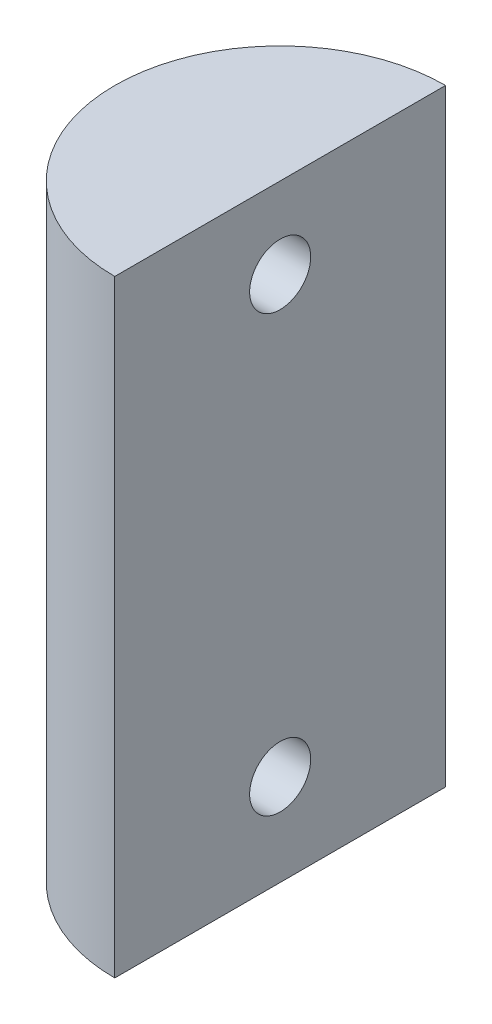
ISO-10303-21;
HEADER;
FILE_DESCRIPTION(('STEP AP214'),'2;1');
FILE_NAME('part.step','',(''),(''),'','','');
FILE_SCHEMA(('AUTOMOTIVE_DESIGN { 1 0 10303 214 1 1 1 1 }'));
ENDSEC;
DATA;
#1=APPLICATION_CONTEXT('core data for automotive mechanical design processes');
#2=APPLICATION_PROTOCOL_DEFINITION('international standard','automotive_design',2000,#1);
#3=PRODUCT_CONTEXT('',#1,'mechanical');
#4=PRODUCT('Part','Part','',(#3));
#5=PRODUCT_RELATED_PRODUCT_CATEGORY('part','',(#4));
#6=PRODUCT_DEFINITION_FORMATION('','',#4);
#7=PRODUCT_DEFINITION_CONTEXT('part definition',#1,'design');
#8=PRODUCT_DEFINITION('design','',#6,#7);
#9=PRODUCT_DEFINITION_SHAPE('','',#8);
#10=(LENGTH_UNIT() NAMED_UNIT(*) SI_UNIT(.MILLI.,.METRE.));
#11=(NAMED_UNIT(*) PLANE_ANGLE_UNIT() SI_UNIT($,.RADIAN.));
#12=(NAMED_UNIT(*) SI_UNIT($,.STERADIAN.) SOLID_ANGLE_UNIT());
#13=UNCERTAINTY_MEASURE_WITH_UNIT(LENGTH_MEASURE(1.E-05),#10,'distance_accuracy_value','');
#14=(GEOMETRIC_REPRESENTATION_CONTEXT(3) GLOBAL_UNCERTAINTY_ASSIGNED_CONTEXT((#13)) GLOBAL_UNIT_ASSIGNED_CONTEXT((#10,
#11,#12)) REPRESENTATION_CONTEXT('',''));
#15=CARTESIAN_POINT('',(0.,0.,0.));
#16=DIRECTION('',(0.,0.,1.));
#17=DIRECTION('',(1.,0.,0.));
#18=AXIS2_PLACEMENT_3D('',#15,#16,#17);
#19=CARTESIAN_POINT('',(0.,-119.376,0.));
#20=DIRECTION('',(-1.,0.,0.));
#21=DIRECTION('',(0.,0.,1.));
#22=AXIS2_PLACEMENT_3D('',#19,#20,#21);
#23=PLANE('',#22);
#24=CARTESIAN_POINT('',(0.,-101.376,0.));
#25=DIRECTION('',(1.,0.,0.));
#26=DIRECTION('',(0.,0.,-1.));
#27=AXIS2_PLACEMENT_3D('',#24,#25,#26);
#28=CIRCLE('',#27,6.);
#29=CARTESIAN_POINT('',(0.,-101.376,-6.));
#30=VERTEX_POINT('',#29);
#31=EDGE_CURVE('E113',#30,#30,#28,.T.);
#32=ORIENTED_EDGE('',*,*,#31,.F.);
#33=EDGE_LOOP('',(#32));
#34=FACE_BOUND('',#33,.T.);
#35=CARTESIAN_POINT('',(0.,-15.894,0.));
#36=DIRECTION('',(1.,0.,0.));
#37=DIRECTION('',(0.,0.,-1.));
#38=AXIS2_PLACEMENT_3D('',#35,#36,#37);
#39=CIRCLE('',#38,6.);
#40=CARTESIAN_POINT('',(0.,-15.894,-6.));
#41=VERTEX_POINT('',#40);
#42=EDGE_CURVE('E89',#41,#41,#39,.T.);
#43=ORIENTED_EDGE('',*,*,#42,.F.);
#44=EDGE_LOOP('',(#43));
#45=FACE_BOUND('',#44,.T.);
#46=DIRECTION('',(0.,0.,1.));
#47=VECTOR('',#46,1.);
#48=CARTESIAN_POINT('',(0.,0.,0.));
#49=LINE('',#48,#47);
#50=CARTESIAN_POINT('',(0.,0.,-32.5));
#51=VERTEX_POINT('',#50);
#52=CARTESIAN_POINT('',(0.,0.,32.5));
#53=VERTEX_POINT('',#52);
#54=EDGE_CURVE('E75',#51,#53,#49,.T.);
#55=ORIENTED_EDGE('',*,*,#54,.T.);
#56=DIRECTION('',(0.,1.,0.));
#57=VECTOR('',#56,1.);
#58=CARTESIAN_POINT('',(0.,-119.376,32.5));
#59=LINE('',#58,#57);
#60=CARTESIAN_POINT('',(0.,-119.376,32.5));
#61=VERTEX_POINT('',#60);
#62=EDGE_CURVE('E11',#61,#53,#59,.T.);
#63=ORIENTED_EDGE('',*,*,#62,.F.);
#64=DIRECTION('',(0.,0.,1.));
#65=VECTOR('',#64,1.);
#66=CARTESIAN_POINT('',(0.,-119.376,0.));
#67=LINE('',#66,#65);
#68=CARTESIAN_POINT('',(0.,-119.376,-32.5));
#69=VERTEX_POINT('',#68);
#70=EDGE_CURVE('E59',#69,#61,#67,.T.);
#71=ORIENTED_EDGE('',*,*,#70,.F.);
#72=DIRECTION('',(0.,1.,0.));
#73=VECTOR('',#72,1.);
#74=CARTESIAN_POINT('',(0.,-119.376,-32.5));
#75=LINE('',#74,#73);
#76=EDGE_CURVE('E51',#69,#51,#75,.T.);
#77=ORIENTED_EDGE('',*,*,#76,.T.);
#78=EDGE_LOOP('',(#55,#63,#71,#77));
#79=FACE_BOUND('',#78,.T.);
#80=ADVANCED_FACE('F38',(#34,#45,#79),#23,.F.);
#81=CARTESIAN_POINT('',(0.,-119.376,0.));
#82=DIRECTION('',(0.,1.,0.));
#83=DIRECTION('',(0.,0.,1.));
#84=AXIS2_PLACEMENT_3D('',#81,#82,#83);
#85=CYLINDRICAL_SURFACE('',#84,32.5);
#86=CARTESIAN_POINT('',(-31.9413525073689,-101.376,-6.));
#87=CARTESIAN_POINT('',(-31.9413510155267,-101.543020105781,-6.00000295853529));
#88=CARTESIAN_POINT('',(-31.9426650102768,-101.710001842829,-5.99302407715925));
#89=CARTESIAN_POINT('',(-31.9478791151134,-102.042812138617,-5.96516856930217));
#90=CARTESIAN_POINT('',(-31.9517796989175,-102.208640480497,-5.94428939706712));
#91=CARTESIAN_POINT('',(-31.9620573065449,-102.537992514205,-5.88877610738074));
#92=CARTESIAN_POINT('',(-31.9684357545158,-102.701514824534,-5.85413407949497));
#93=CARTESIAN_POINT('',(-31.9834845406126,-103.025062361184,-5.77135045100128));
#94=CARTESIAN_POINT('',(-31.9921557212921,-103.18508627843,-5.72320388723111));
#95=CARTESIAN_POINT('',(-32.0115246934935,-103.500246490147,-5.61385452206621));
#96=CARTESIAN_POINT('',(-32.0222198341718,-103.655388871567,-5.55266878540925));
#97=CARTESIAN_POINT('',(-32.0453420785026,-103.959993638257,-5.41763251250718));
#98=CARTESIAN_POINT('',(-32.0577698204828,-104.109453904166,-5.34377730623473));
#99=CARTESIAN_POINT('',(-32.0839962627161,-104.401552629714,-5.18398806674357));
#100=CARTESIAN_POINT('',(-32.0977943188948,-104.544194247985,-5.09805970034271));
#101=CARTESIAN_POINT('',(-32.1263856672193,-104.821828347411,-4.91466745622354));
#102=CARTESIAN_POINT('',(-32.1411793293463,-104.956817950254,-4.81719927981946));
#103=CARTESIAN_POINT('',(-32.1715052735179,-105.219560996205,-4.61034548396164));
#104=CARTESIAN_POINT('',(-32.1870436584928,-105.347224083592,-4.5008459742891));
#105=CARTESIAN_POINT('',(-32.2182832804324,-105.592946537089,-4.27148905640615));
#106=CARTESIAN_POINT('',(-32.2339845755935,-105.711002327964,-4.15162782612188));
#107=CARTESIAN_POINT('',(-32.2651012097674,-105.936618341113,-3.90243530466569));
#108=CARTESIAN_POINT('',(-32.2805166335572,-106.044181716642,-3.77310687922168));
#109=CARTESIAN_POINT('',(-32.3106427456994,-106.248146891922,-3.50577559302649));
#110=CARTESIAN_POINT('',(-32.3253531722095,-106.344544563181,-3.36776955266252));
#111=CARTESIAN_POINT('',(-32.3537527138724,-106.526088678451,-3.08306471017447));
#112=CARTESIAN_POINT('',(-32.3674339230622,-106.611151271087,-2.93631162303768));
#113=CARTESIAN_POINT('',(-32.3932768150282,-106.76862626248,-2.63597199364875));
#114=CARTESIAN_POINT('',(-32.405437928495,-106.841033925708,-2.48238292019941));
#115=CARTESIAN_POINT('',(-32.4278825976848,-106.972586679502,-2.16955749285648));
#116=CARTESIAN_POINT('',(-32.4381669640968,-107.031737499093,-2.01032361299022));
#117=CARTESIAN_POINT('',(-32.4565759252547,-107.136376316327,-1.6872898594089));
#118=CARTESIAN_POINT('',(-32.4646997333147,-107.181859338139,-1.5234883464818));
#119=CARTESIAN_POINT('',(-32.4852880303493,-107.296290031532,-1.03085331580681));
#120=CARTESIAN_POINT('',(-32.4942588120657,-107.34486042554,-0.696870045496302));
#121=CARTESIAN_POINT('',(-32.5017263371873,-107.385373397857,-0.0255664198837376));
#122=CARTESIAN_POINT('',(-32.5002239463955,-107.377320657124,0.31175365726685));
#123=CARTESIAN_POINT('',(-32.4870176310848,-107.305377926863,0.976054278284205));
#124=CARTESIAN_POINT('',(-32.4754378068713,-107.242167164928,1.30311063675732));
#125=CARTESIAN_POINT('',(-32.4435119174272,-107.062755984159,1.94188038235149));
#126=CARTESIAN_POINT('',(-32.4231655399838,-106.946553678071,2.25359322258673));
#127=CARTESIAN_POINT('',(-32.3757858792464,-106.663811975478,2.85482127182886));
#128=CARTESIAN_POINT('',(-32.3487165042421,-106.49699977746,3.14420524520471));
#129=CARTESIAN_POINT('',(-32.2908861364092,-106.117972872398,3.69112726413707));
#130=CARTESIAN_POINT('',(-32.2601247793352,-105.905753683949,3.94866216241415));
#131=CARTESIAN_POINT('',(-32.1977799600073,-105.438189714966,4.42860067861483));
#132=CARTESIAN_POINT('',(-32.1661910748591,-105.182250600413,4.65042497033573));
#133=CARTESIAN_POINT('',(-32.1061894073334,-104.636494957064,5.04808559706013));
#134=CARTESIAN_POINT('',(-32.077776668672,-104.346677962086,5.22392129912474));
#135=CARTESIAN_POINT('',(-32.0273370970672,-103.740639341077,5.52477115699434));
#136=CARTESIAN_POINT('',(-32.0053205950001,-103.424376049523,5.64970322536738));
#137=CARTESIAN_POINT('',(-31.9703261346543,-102.774850988088,5.84449643174312));
#138=CARTESIAN_POINT('',(-31.9573471859124,-102.441591085235,5.9143636046489));
#139=CARTESIAN_POINT('',(-31.9420927158332,-101.772751015839,5.99620229168364));
#140=CARTESIAN_POINT('',(-31.9396635072359,-101.437275977497,6.00900518397556));
#141=CARTESIAN_POINT('',(-31.9453725765504,-100.768981018201,5.9785785831626));
#142=CARTESIAN_POINT('',(-31.9535103486703,-100.436160970932,5.93535177193744));
#143=CARTESIAN_POINT('',(-31.979293465026,-99.7853432915108,5.79480586142508));
#144=CARTESIAN_POINT('',(-31.9968624934417,-99.4672486424835,5.69792075735497));
#145=CARTESIAN_POINT('',(-32.0394630353324,-98.8518079669587,5.45326809850266));
#146=CARTESIAN_POINT('',(-32.0644950840986,-98.5544634306683,5.30549689375586));
#147=CARTESIAN_POINT('',(-32.1195522144905,-97.9852954141647,4.96134651750512));
#148=CARTESIAN_POINT('',(-32.1496301190139,-97.7137953660428,4.76444105467971));
#149=CARTESIAN_POINT('',(-32.2112404635557,-97.2073897261277,4.328321885264));
#150=CARTESIAN_POINT('',(-32.2427730300079,-96.9724873230619,4.08910449593802));
#151=CARTESIAN_POINT('',(-32.3042327039953,-96.5428487984119,3.57144762775753));
#152=CARTESIAN_POINT('',(-32.3341337897011,-96.3486711361731,3.29254111714155));
#153=CARTESIAN_POINT('',(-32.3885259688709,-96.0099325863055,2.70556807005943));
#154=CARTESIAN_POINT('',(-32.4130172660944,-95.8653698298182,2.39750263248845));
#155=CARTESIAN_POINT('',(-32.453720812997,-95.6308001775852,1.7625807268193));
#156=CARTESIAN_POINT('',(-32.4699750052543,-95.5405164504713,1.43582908021701));
#157=CARTESIAN_POINT('',(-32.4925422562138,-95.4162027598243,0.771284675971638));
#158=CARTESIAN_POINT('',(-32.4988563275773,-95.3821670659399,0.433493046619086));
#159=CARTESIAN_POINT('',(-32.5003540565631,-95.3740959848788,-0.0710321096354862));
#160=CARTESIAN_POINT('',(-32.4995572690841,-95.3783921897452,-0.237682638844524));
#161=CARTESIAN_POINT('',(-32.495424432952,-95.4008200641112,-0.570001473574034));
#162=CARTESIAN_POINT('',(-32.4920893427311,-95.4189465114863,-0.735670126050064));
#163=CARTESIAN_POINT('',(-32.4829668638015,-95.4689088068172,-1.06490505616126));
#164=CARTESIAN_POINT('',(-32.4771786148997,-95.5007494636854,-1.22847057559065));
#165=CARTESIAN_POINT('',(-32.4633144843585,-95.5778772460574,-1.55224085017753));
#166=CARTESIAN_POINT('',(-32.4552394235426,-95.6231595471253,-1.71244678909536));
#167=CARTESIAN_POINT('',(-32.4370355937856,-95.7267635833937,-2.02822736208988));
#168=CARTESIAN_POINT('',(-32.4269095551274,-95.7850679939146,-2.18380784113108));
#169=CARTESIAN_POINT('',(-32.4048786716608,-95.9142959094409,-2.48943892302124));
#170=CARTESIAN_POINT('',(-32.3929744609303,-95.9852149179221,-2.63949147339193));
#171=CARTESIAN_POINT('',(-32.3677035827214,-96.1392067767066,-2.93317210590939));
#172=CARTESIAN_POINT('',(-32.3543363286126,-96.2222845067763,-3.07679757825833));
#173=CARTESIAN_POINT('',(-32.326510815552,-96.3999579793895,-3.35655401432148));
#174=CARTESIAN_POINT('',(-32.3120529366048,-96.494549717111,-3.49268756010242));
#175=CARTESIAN_POINT('',(-32.2822211930687,-96.6960564389901,-3.75850222746007));
#176=CARTESIAN_POINT('',(-32.2668371982912,-96.803128074562,-3.88806348648546));
#177=CARTESIAN_POINT('',(-32.2357777361537,-97.0276986066352,-4.1376867350828));
#178=CARTESIAN_POINT('',(-32.2201023739441,-97.1451937970361,-4.25775207244293));
#179=CARTESIAN_POINT('',(-32.188881874074,-97.3899179927548,-4.48768949162615));
#180=CARTESIAN_POINT('',(-32.1733368199346,-97.5171527795317,-4.59755543208626));
#181=CARTESIAN_POINT('',(-32.1428277311297,-97.7803839559098,-4.8062192058397));
#182=CARTESIAN_POINT('',(-32.1278634847102,-97.916377103324,-4.90502109816961));
#183=CARTESIAN_POINT('',(-32.0987973355248,-98.1975537726137,-5.09178042683274));
#184=CARTESIAN_POINT('',(-32.084704774444,-98.3428111641444,-5.1796281571812));
#185=CARTESIAN_POINT('',(-32.0579500798171,-98.6402919089007,-5.34272083193665));
#186=CARTESIAN_POINT('',(-32.0452874201016,-98.7925126706109,-5.4179704171096));
#187=CARTESIAN_POINT('',(-32.0217661734497,-99.1028057270561,-5.55529909721155));
#188=CARTESIAN_POINT('',(-32.0109064112641,-99.2608741270677,-5.61738677931813));
#189=CARTESIAN_POINT('',(-31.9913049603576,-99.5817703702512,-5.72796202752484));
#190=CARTESIAN_POINT('',(-31.9825628397174,-99.7445972352696,-5.77645236729059));
#191=CARTESIAN_POINT('',(-31.964037017176,-100.148538416944,-5.87827970156251));
#192=CARTESIAN_POINT('',(-31.9555746068072,-100.391711803916,-5.92386631533028));
#193=CARTESIAN_POINT('',(-31.9442335268558,-100.881951494842,-5.98472388662139));
#194=CARTESIAN_POINT('',(-31.9413547134423,-101.129017698353,-5.99999562504256));
#195=CARTESIAN_POINT('',(-31.9413525073689,-101.376,-6.));
#196=B_SPLINE_CURVE_WITH_KNOTS('',3,(#86,#87,#88,#89,#90,#91,#92,#93,#94,#95,#96,#97,#98,#99,
#100,#101,#102,#103,#104,#105,#106,#107,#108,#109,#110,#111,#112,#113,#114,#115,#116,#117,#118,
#119,#120,#121,#122,#123,#124,#125,#126,#127,#128,#129,#130,#131,#132,#133,#134,#135,#136,#137,
#138,#139,#140,#141,#142,#143,#144,#145,#146,#147,#148,#149,#150,#151,#152,#153,#154,#155,#156,
#157,#158,#159,#160,#161,#162,#163,#164,#165,#166,#167,#168,#169,#170,#171,#172,#173,#174,#175,
#176,#177,#178,#179,#180,#181,#182,#183,#184,#185,#186,#187,#188,#189,#190,#191,#192,#193,#194,
#195),.UNSPECIFIED.,.T.,.F.,(4,2,2,2,2,2,2,2,2,2,2,2,2,2,2,2,2,2,2,2,2,2,2,2,2,2,2,2,2,2,2,2,2,
2,2,2,2,2,2,2,2,2,2,2,2,2,2,2,2,2,2,2,2,2,4),(0.,0.500843463331397,1.0017786783503,
1.5030022318823,2.00441023608585,2.50516601956037,3.00610678220385,3.50681319732149,
4.00770672054381,4.51383441416538,5.02014960364326,5.52631215984352,6.03266127501114,
6.542569670539,7.05266846938636,7.56254639910262,8.07260972824401,9.08012563787735,
10.087558258518,11.0827574722959,12.0779921321037,13.0786896815496,14.0794860395937,
15.0951637423724,16.1108554231421,17.128178591491,18.1453902495802,19.1477325069965,
20.1500267887514,21.144330335666,22.1387052169704,23.1442262843942,24.1498349132333,
25.1684425209453,26.1870117562707,27.2003410634462,28.2135671298398,28.7132031034217,
29.2126505140953,29.7122731996682,30.2117167784931,30.7104998117235,31.2091054067347,
31.7079116630686,32.2065449168667,32.7122968113089,33.217869600612,33.7237448623406,
34.2294339227624,34.7398381371698,35.2500539188164,35.7599357905253,36.269713577754,
37.0103588870579,37.7509851174174),.UNSPECIFIED.);
#197=CARTESIAN_POINT('',(-31.9413525073689,-101.376,-6.));
#198=VERTEX_POINT('',#197);
#199=EDGE_CURVE('E41',#198,#198,#196,.T.);
#200=ORIENTED_EDGE('',*,*,#199,.F.);
#201=EDGE_LOOP('',(#200));
#202=FACE_BOUND('',#201,.T.);
#203=CARTESIAN_POINT('',(-31.9413525073689,-15.894,-6.));
#204=CARTESIAN_POINT('',(-31.9413510155267,-16.0610201057805,-6.00000295853529));
#205=CARTESIAN_POINT('',(-31.9426650102768,-16.2280018428286,-5.99302407715925));
#206=CARTESIAN_POINT('',(-31.9478791151134,-16.5608121386166,-5.96516856930217));
#207=CARTESIAN_POINT('',(-31.9517796989175,-16.7266404804968,-5.94428939706712));
#208=CARTESIAN_POINT('',(-31.9620573065449,-17.0559925142051,-5.88877610738075));
#209=CARTESIAN_POINT('',(-31.9684357545158,-17.2195148245342,-5.85413407949497));
#210=CARTESIAN_POINT('',(-31.9834845406126,-17.5430623611839,-5.77135045100128));
#211=CARTESIAN_POINT('',(-31.9921557212921,-17.7030862784299,-5.72320388723111));
#212=CARTESIAN_POINT('',(-32.0115246934935,-18.0182464901465,-5.61385452206621));
#213=CARTESIAN_POINT('',(-32.0222198341718,-18.1733888715672,-5.55266878540925));
#214=CARTESIAN_POINT('',(-32.0453420785026,-18.4779936382573,-5.41763251250718));
#215=CARTESIAN_POINT('',(-32.0577698204828,-18.6274539041662,-5.34377730623473));
#216=CARTESIAN_POINT('',(-32.0839962627161,-18.9195526297136,-5.18398806674358));
#217=CARTESIAN_POINT('',(-32.0977943188948,-19.0621942479849,-5.09805970034271));
#218=CARTESIAN_POINT('',(-32.1263856672193,-19.339828347411,-4.91466745622354));
#219=CARTESIAN_POINT('',(-32.1411793293463,-19.4748179502543,-4.81719927981947));
#220=CARTESIAN_POINT('',(-32.1715052735179,-19.7375609962047,-4.61034548396164));
#221=CARTESIAN_POINT('',(-32.1870436584928,-19.865224083592,-4.5008459742891));
#222=CARTESIAN_POINT('',(-32.2182832804324,-20.1109465370888,-4.27148905640615));
#223=CARTESIAN_POINT('',(-32.2339845755935,-20.2290023279637,-4.15162782612188));
#224=CARTESIAN_POINT('',(-32.2651012097674,-20.4546183411127,-3.90243530466569));
#225=CARTESIAN_POINT('',(-32.2805166335572,-20.5621817166419,-3.77310687922168));
#226=CARTESIAN_POINT('',(-32.3106427456994,-20.7661468919223,-3.50577559302649));
#227=CARTESIAN_POINT('',(-32.3253531722095,-20.8625445631812,-3.36776955266252));
#228=CARTESIAN_POINT('',(-32.3537527138724,-21.0440886784513,-3.08306471017447));
#229=CARTESIAN_POINT('',(-32.3674339230622,-21.1291512710868,-2.93631162303769));
#230=CARTESIAN_POINT('',(-32.3932768150282,-21.2866262624802,-2.63597199364875));
#231=CARTESIAN_POINT('',(-32.405437928495,-21.3590339257077,-2.48238292019941));
#232=CARTESIAN_POINT('',(-32.4278825976848,-21.490586679502,-2.16955749285648));
#233=CARTESIAN_POINT('',(-32.4381669640968,-21.5497374990927,-2.01032361299023));
#234=CARTESIAN_POINT('',(-32.4565759252547,-21.6543763163272,-1.6872898594089));
#235=CARTESIAN_POINT('',(-32.4646997333147,-21.699859338139,-1.5234883464818));
#236=CARTESIAN_POINT('',(-32.4852880303493,-21.8142900315319,-1.03085331580681));
#237=CARTESIAN_POINT('',(-32.4942588120657,-21.8628604255396,-0.696870045496302));
#238=CARTESIAN_POINT('',(-32.5017263371873,-21.9033733978569,-0.0255664198837394));
#239=CARTESIAN_POINT('',(-32.5002239463955,-21.8953206571241,0.311753657266847));
#240=CARTESIAN_POINT('',(-32.4870176310848,-21.8233779268632,0.976054278284202));
#241=CARTESIAN_POINT('',(-32.4754378068713,-21.7601671649283,1.30311063675732));
#242=CARTESIAN_POINT('',(-32.4435119174272,-21.5807559841587,1.94188038235149));
#243=CARTESIAN_POINT('',(-32.4231655399838,-21.4645536780706,2.25359322258672));
#244=CARTESIAN_POINT('',(-32.3757858792464,-21.1818119754776,2.85482127182885));
#245=CARTESIAN_POINT('',(-32.3487165042421,-21.0149997774601,3.14420524520471));
#246=CARTESIAN_POINT('',(-32.2908861364092,-20.6359728723981,3.69112726413707));
#247=CARTESIAN_POINT('',(-32.2601247793352,-20.4237536839487,3.94866216241414));
#248=CARTESIAN_POINT('',(-32.1977799600073,-19.9561897149659,4.42860067861482));
#249=CARTESIAN_POINT('',(-32.1661910748591,-19.7002506004133,4.65042497033573));
#250=CARTESIAN_POINT('',(-32.1061894073334,-19.1544949570636,5.04808559706013));
#251=CARTESIAN_POINT('',(-32.077776668672,-18.864677962086,5.22392129912473));
#252=CARTESIAN_POINT('',(-32.0273370970672,-18.2586393410768,5.52477115699434));
#253=CARTESIAN_POINT('',(-32.0053205950001,-17.9423760495226,5.64970322536738));
#254=CARTESIAN_POINT('',(-31.9703261346543,-17.2928509880879,5.84449643174312));
#255=CARTESIAN_POINT('',(-31.9573471859124,-16.9595910852348,5.9143636046489));
#256=CARTESIAN_POINT('',(-31.9420927158332,-16.2907510158392,5.99620229168363));
#257=CARTESIAN_POINT('',(-31.9396635072359,-15.9552759774973,6.00900518397555));
#258=CARTESIAN_POINT('',(-31.9453725765504,-15.2869810182009,5.9785785831626));
#259=CARTESIAN_POINT('',(-31.9535103486703,-14.9541609709316,5.93535177193744));
#260=CARTESIAN_POINT('',(-31.979293465026,-14.3033432915108,5.79480586142508));
#261=CARTESIAN_POINT('',(-31.9968624934417,-13.9852486424835,5.69792075735497));
#262=CARTESIAN_POINT('',(-32.0394630353324,-13.3698079669587,5.45326809850266));
#263=CARTESIAN_POINT('',(-32.0644950840986,-13.0724634306683,5.30549689375586));
#264=CARTESIAN_POINT('',(-32.1195522144905,-12.5032954141647,4.96134651750512));
#265=CARTESIAN_POINT('',(-32.1496301190139,-12.2317953660428,4.76444105467971));
#266=CARTESIAN_POINT('',(-32.2112404635557,-11.7253897261277,4.328321885264));
#267=CARTESIAN_POINT('',(-32.2427730300079,-11.4904873230619,4.08910449593802));
#268=CARTESIAN_POINT('',(-32.3042327039953,-11.0608487984119,3.57144762775752));
#269=CARTESIAN_POINT('',(-32.3341337897011,-10.8666711361731,3.29254111714154));
#270=CARTESIAN_POINT('',(-32.3885259688709,-10.5279325863055,2.70556807005942));
#271=CARTESIAN_POINT('',(-32.4130172660944,-10.3833698298182,2.39750263248844));
#272=CARTESIAN_POINT('',(-32.453720812997,-10.1488001775852,1.76258072681929));
#273=CARTESIAN_POINT('',(-32.4699750052543,-10.0585164504713,1.435829080217));
#274=CARTESIAN_POINT('',(-32.4925422562138,-9.93420275982427,0.771284675971634));
#275=CARTESIAN_POINT('',(-32.4988563275773,-9.90016706593986,0.433493046619084));
#276=CARTESIAN_POINT('',(-32.5003540565631,-9.89209598487879,-0.0710321096354854));
#277=CARTESIAN_POINT('',(-32.4995572690841,-9.89639218974524,-0.237682638844523));
#278=CARTESIAN_POINT('',(-32.495424432952,-9.91882006411115,-0.570001473574032));
#279=CARTESIAN_POINT('',(-32.4920893427311,-9.93694651148627,-0.735670126050062));
#280=CARTESIAN_POINT('',(-32.4829668638015,-9.98690880681719,-1.06490505616126));
#281=CARTESIAN_POINT('',(-32.4771786148997,-10.0187494636854,-1.22847057559065));
#282=CARTESIAN_POINT('',(-32.4633144843585,-10.0958772460574,-1.55224085017753));
#283=CARTESIAN_POINT('',(-32.4552394235426,-10.1411595471253,-1.71244678909536));
#284=CARTESIAN_POINT('',(-32.4370355937856,-10.2447635833937,-2.02822736208988));
#285=CARTESIAN_POINT('',(-32.4269095551274,-10.3030679939145,-2.18380784113108));
#286=CARTESIAN_POINT('',(-32.4048786716608,-10.4322959094408,-2.48943892302124));
#287=CARTESIAN_POINT('',(-32.3929744609303,-10.5032149179221,-2.63949147339193));
#288=CARTESIAN_POINT('',(-32.3677035827214,-10.6572067767066,-2.93317210590939));
#289=CARTESIAN_POINT('',(-32.3543363286126,-10.7402845067763,-3.07679757825833));
#290=CARTESIAN_POINT('',(-32.326510815552,-10.9179579793895,-3.35655401432148));
#291=CARTESIAN_POINT('',(-32.3120529366048,-11.012549717111,-3.49268756010242));
#292=CARTESIAN_POINT('',(-32.2822211930687,-11.2140564389901,-3.75850222746006));
#293=CARTESIAN_POINT('',(-32.2668371982912,-11.321128074562,-3.88806348648545));
#294=CARTESIAN_POINT('',(-32.2357777361537,-11.5456986066352,-4.13768673508279));
#295=CARTESIAN_POINT('',(-32.2201023739441,-11.6631937970361,-4.25775207244292));
#296=CARTESIAN_POINT('',(-32.188881874074,-11.9079179927548,-4.48768949162615));
#297=CARTESIAN_POINT('',(-32.1733368199346,-12.0351527795317,-4.59755543208626));
#298=CARTESIAN_POINT('',(-32.1428277311297,-12.2983839559098,-4.8062192058397));
#299=CARTESIAN_POINT('',(-32.1278634847102,-12.434377103324,-4.9050210981696));
#300=CARTESIAN_POINT('',(-32.0987973355248,-12.7155537726137,-5.09178042683274));
#301=CARTESIAN_POINT('',(-32.084704774444,-12.8608111641444,-5.17962815718121));
#302=CARTESIAN_POINT('',(-32.0579500798171,-13.1582919089007,-5.34272083193666));
#303=CARTESIAN_POINT('',(-32.0452874201016,-13.3105126706109,-5.41797041710961));
#304=CARTESIAN_POINT('',(-32.0217661734497,-13.6208057270561,-5.55529909721155));
#305=CARTESIAN_POINT('',(-32.0109064112641,-13.7788741270677,-5.61738677931814));
#306=CARTESIAN_POINT('',(-31.9913049603576,-14.0997703702512,-5.72796202752485));
#307=CARTESIAN_POINT('',(-31.9825628397174,-14.2625972352697,-5.7764523672906));
#308=CARTESIAN_POINT('',(-31.9640370171761,-14.6665384169445,-5.87827970156251));
#309=CARTESIAN_POINT('',(-31.9555746068072,-14.9097118039164,-5.92386631533029));
#310=CARTESIAN_POINT('',(-31.9442335268558,-15.3999514948419,-5.9847238866214));
#311=CARTESIAN_POINT('',(-31.9413547134423,-15.647017698353,-5.99999562504256));
#312=CARTESIAN_POINT('',(-31.9413525073689,-15.894,-6.));
#313=B_SPLINE_CURVE_WITH_KNOTS('',3,(#203,#204,#205,#206,#207,#208,#209,#210,#211,#212,#213,
#214,#215,#216,#217,#218,#219,#220,#221,#222,#223,#224,#225,#226,#227,#228,#229,#230,#231,#232,
#233,#234,#235,#236,#237,#238,#239,#240,#241,#242,#243,#244,#245,#246,#247,#248,#249,#250,#251,
#252,#253,#254,#255,#256,#257,#258,#259,#260,#261,#262,#263,#264,#265,#266,#267,#268,#269,#270,
#271,#272,#273,#274,#275,#276,#277,#278,#279,#280,#281,#282,#283,#284,#285,#286,#287,#288,#289,
#290,#291,#292,#293,#294,#295,#296,#297,#298,#299,#300,#301,#302,#303,#304,#305,#306,#307,#308,
#309,#310,#311,#312),.UNSPECIFIED.,.T.,.F.,(4,2,2,2,2,2,2,2,2,2,2,2,2,2,2,2,2,2,2,2,2,2,2,2,2,2,
2,2,2,2,2,2,2,2,2,2,2,2,2,2,2,2,2,2,2,2,2,2,2,2,2,2,2,2,4),(0.,0.500843463331394,
1.0017786783503,1.50300223188231,2.00441023608585,2.50516601956036,3.00610678220385,
3.50681319732148,4.00770672054381,4.51383441416538,5.02014960364325,5.52631215984352,
6.03266127501113,6.54256967053899,7.05266846938636,7.56254639910262,8.07260972824401,
9.08012563787735,10.087558258518,11.0827574722959,12.0779921321037,13.0786896815496,
14.0794860395937,15.0951637423724,16.1108554231421,17.128178591491,18.1453902495802,
19.1477325069965,20.1500267887514,21.144330335666,22.1387052169703,23.1442262843942,
24.1498349132333,25.1684425209453,26.1870117562707,27.2003410634462,28.2135671298398,
28.7132031034217,29.2126505140953,29.7122731996682,30.2117167784931,30.7104998117235,
31.2091054067347,31.7079116630686,32.2065449168667,32.7122968113089,33.217869600612,
33.7237448623405,34.2294339227624,34.7398381371698,35.2500539188164,35.7599357905253,
36.269713577754,37.0103588870579,37.7509851174174),.UNSPECIFIED.);
#314=CARTESIAN_POINT('',(-31.9413525073689,-15.894,-6.));
#315=VERTEX_POINT('',#314);
#316=EDGE_CURVE('E77',#315,#315,#313,.T.);
#317=ORIENTED_EDGE('',*,*,#316,.F.);
#318=EDGE_LOOP('',(#317));
#319=FACE_BOUND('',#318,.T.);
#320=CARTESIAN_POINT('',(0.,0.,0.));
#321=DIRECTION('',(0.,1.,0.));
#322=DIRECTION('',(0.,0.,1.));
#323=AXIS2_PLACEMENT_3D('',#320,#321,#322);
#324=CIRCLE('',#323,32.5);
#325=EDGE_CURVE('E73',#51,#53,#324,.T.);
#326=ORIENTED_EDGE('',*,*,#325,.F.);
#327=ORIENTED_EDGE('',*,*,#76,.F.);
#328=CARTESIAN_POINT('',(0.,-119.376,0.));
#329=DIRECTION('',(0.,1.,0.));
#330=DIRECTION('',(0.,0.,1.));
#331=AXIS2_PLACEMENT_3D('',#328,#329,#330);
#332=CIRCLE('',#331,32.5);
#333=EDGE_CURVE('E74',#69,#61,#332,.T.);
#334=ORIENTED_EDGE('',*,*,#333,.T.);
#335=ORIENTED_EDGE('',*,*,#62,.T.);
#336=EDGE_LOOP('',(#326,#327,#334,#335));
#337=FACE_BOUND('',#336,.T.);
#338=ADVANCED_FACE('F71',(#202,#319,#337),#85,.T.);
#339=CARTESIAN_POINT('',(0.,-119.376,0.));
#340=DIRECTION('',(0.,1.,0.));
#341=DIRECTION('',(0.,0.,1.));
#342=AXIS2_PLACEMENT_3D('',#339,#340,#341);
#343=PLANE('',#342);
#344=ORIENTED_EDGE('',*,*,#70,.T.);
#345=ORIENTED_EDGE('',*,*,#333,.F.);
#346=EDGE_LOOP('',(#344,#345));
#347=FACE_BOUND('',#346,.T.);
#348=ADVANCED_FACE('F99',(#347),#343,.F.);
#349=CARTESIAN_POINT('',(0.,0.,0.));
#350=DIRECTION('',(0.,1.,0.));
#351=DIRECTION('',(0.,0.,1.));
#352=AXIS2_PLACEMENT_3D('',#349,#350,#351);
#353=PLANE('',#352);
#354=ORIENTED_EDGE('',*,*,#54,.F.);
#355=ORIENTED_EDGE('',*,*,#325,.T.);
#356=EDGE_LOOP('',(#354,#355));
#357=FACE_BOUND('',#356,.T.);
#358=ADVANCED_FACE('F79',(#357),#353,.T.);
#359=CARTESIAN_POINT('',(-56.,-15.894,0.));
#360=DIRECTION('',(1.,0.,0.));
#361=DIRECTION('',(0.,0.,-1.));
#362=AXIS2_PLACEMENT_3D('',#359,#360,#361);
#363=CYLINDRICAL_SURFACE('',#362,6.);
#364=ORIENTED_EDGE('',*,*,#316,.T.);
#365=EDGE_LOOP('',(#364));
#366=FACE_BOUND('',#365,.T.);
#367=ORIENTED_EDGE('',*,*,#42,.T.);
#368=EDGE_LOOP('',(#367));
#369=FACE_BOUND('',#368,.T.);
#370=ADVANCED_FACE('F92',(#366,#369),#363,.F.);
#371=CARTESIAN_POINT('',(-56.,-101.376,0.));
#372=DIRECTION('',(1.,0.,0.));
#373=DIRECTION('',(0.,0.,-1.));
#374=AXIS2_PLACEMENT_3D('',#371,#372,#373);
#375=CYLINDRICAL_SURFACE('',#374,6.);
#376=ORIENTED_EDGE('',*,*,#199,.T.);
#377=EDGE_LOOP('',(#376));
#378=FACE_BOUND('',#377,.T.);
#379=ORIENTED_EDGE('',*,*,#31,.T.);
#380=EDGE_LOOP('',(#379));
#381=FACE_BOUND('',#380,.T.);
#382=ADVANCED_FACE('F96',(#378,#381),#375,.F.);
#383=CLOSED_SHELL('',(#80,#338,#348,#358,#370,#382));
#384=MANIFOLD_SOLID_BREP('B2',#383);
#385=ADVANCED_BREP_SHAPE_REPRESENTATION('',(#18,#384),#14);
#386=SHAPE_DEFINITION_REPRESENTATION(#9,#385);
ENDSEC;
END-ISO-10303-21;
